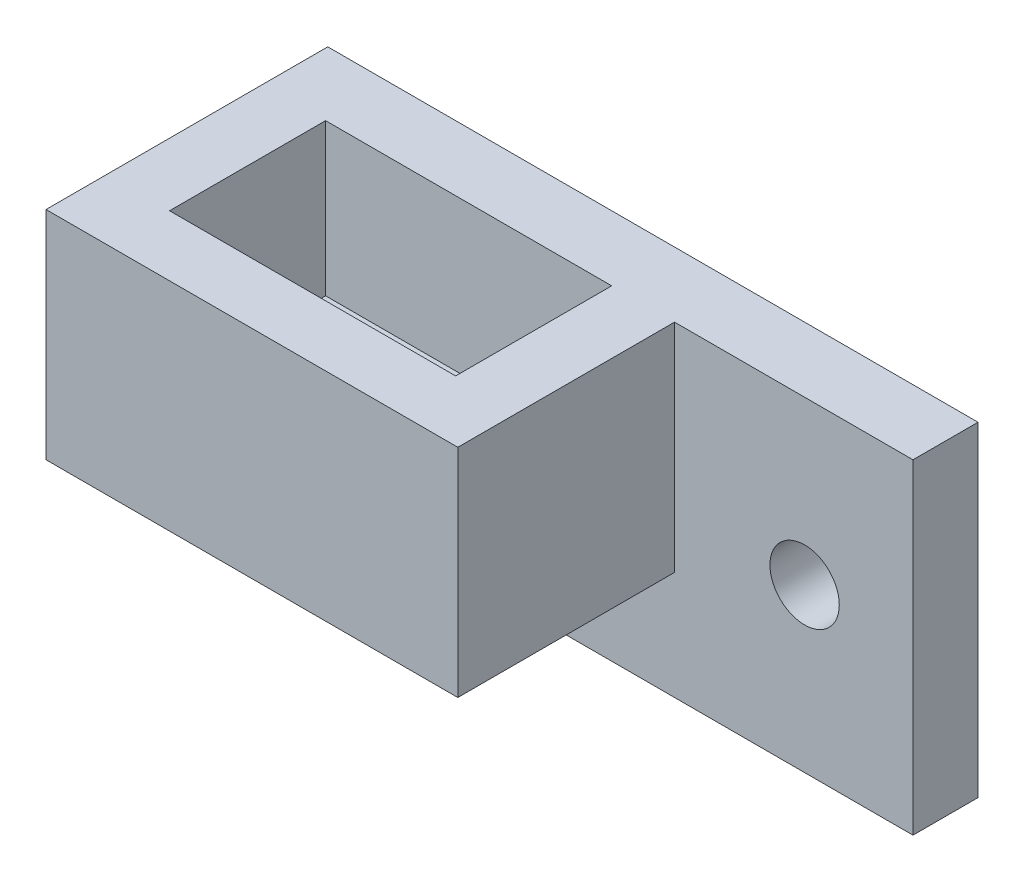
ISO-10303-21;
HEADER;
FILE_DESCRIPTION(('STEP AP214'),'2;1');
FILE_NAME('part.step','',(''),(''),'','','');
FILE_SCHEMA(('AUTOMOTIVE_DESIGN { 1 0 10303 214 1 1 1 1 }'));
ENDSEC;
DATA;
#1=APPLICATION_CONTEXT('core data for automotive mechanical design processes');
#2=APPLICATION_PROTOCOL_DEFINITION('international standard','automotive_design',2000,#1);
#3=PRODUCT_CONTEXT('',#1,'mechanical');
#4=PRODUCT('Part','Part','',(#3));
#5=PRODUCT_RELATED_PRODUCT_CATEGORY('part','',(#4));
#6=PRODUCT_DEFINITION_FORMATION('','',#4);
#7=PRODUCT_DEFINITION_CONTEXT('part definition',#1,'design');
#8=PRODUCT_DEFINITION('design','',#6,#7);
#9=PRODUCT_DEFINITION_SHAPE('','',#8);
#10=(LENGTH_UNIT() NAMED_UNIT(*) SI_UNIT(.MILLI.,.METRE.));
#11=(NAMED_UNIT(*) PLANE_ANGLE_UNIT() SI_UNIT($,.RADIAN.));
#12=(NAMED_UNIT(*) SI_UNIT($,.STERADIAN.) SOLID_ANGLE_UNIT());
#13=UNCERTAINTY_MEASURE_WITH_UNIT(LENGTH_MEASURE(1.E-05),#10,'distance_accuracy_value','');
#14=(GEOMETRIC_REPRESENTATION_CONTEXT(3) GLOBAL_UNCERTAINTY_ASSIGNED_CONTEXT((#13)) GLOBAL_UNIT_ASSIGNED_CONTEXT((#10,
#11,#12)) REPRESENTATION_CONTEXT('',''));
#15=CARTESIAN_POINT('',(0.,0.,0.));
#16=DIRECTION('',(0.,0.,1.));
#17=DIRECTION('',(1.,0.,0.));
#18=AXIS2_PLACEMENT_3D('',#15,#16,#17);
#19=CARTESIAN_POINT('',(-28.2998312846469,5.,3.));
#20=DIRECTION('',(0.,1.,0.));
#21=DIRECTION('',(-1.,0.,0.));
#22=AXIS2_PLACEMENT_3D('',#19,#20,#21);
#23=PLANE('',#22);
#24=CARTESIAN_POINT('',(-33.7998312846469,5.,6.5));
#25=DIRECTION('',(0.,1.,0.));
#26=DIRECTION('',(0.,0.,1.));
#27=AXIS2_PLACEMENT_3D('',#24,#25,#26);
#28=CIRCLE('',#27,3.2);
#29=CARTESIAN_POINT('',(-33.7998312846469,5.,9.7));
#30=VERTEX_POINT('',#29);
#31=EDGE_CURVE('E177',#30,#30,#28,.T.);
#32=ORIENTED_EDGE('',*,*,#31,.T.);
#33=EDGE_LOOP('',(#32));
#34=FACE_BOUND('',#33,.T.);
#35=DIRECTION('',(0.,0.,-1.));
#36=VECTOR('',#35,1.);
#37=CARTESIAN_POINT('',(-31.2998312846469,5.,3.));
#38=LINE('',#37,#36);
#39=CARTESIAN_POINT('',(-31.2998312846469,5.,3.));
#40=VERTEX_POINT('',#39);
#41=CARTESIAN_POINT('',(-31.2998312846469,5.,0.));
#42=VERTEX_POINT('',#41);
#43=EDGE_CURVE('E148',#40,#42,#38,.T.);
#44=ORIENTED_EDGE('',*,*,#43,.F.);
#45=DIRECTION('',(1.,0.,0.));
#46=VECTOR('',#45,1.);
#47=CARTESIAN_POINT('',(-43.2998312846469,5.,3.));
#48=LINE('',#47,#46);
#49=CARTESIAN_POINT('',(-24.2998312846469,5.,3.));
#50=VERTEX_POINT('',#49);
#51=EDGE_CURVE('E11',#40,#50,#48,.T.);
#52=ORIENTED_EDGE('',*,*,#51,.T.);
#53=DIRECTION('',(0.,0.,-1.));
#54=VECTOR('',#53,1.);
#55=CARTESIAN_POINT('',(-24.2998312846469,5.,13.));
#56=LINE('',#55,#54);
#57=CARTESIAN_POINT('',(-24.2998312846469,5.,13.));
#58=VERTEX_POINT('',#57);
#59=EDGE_CURVE('E226',#58,#50,#56,.T.);
#60=ORIENTED_EDGE('',*,*,#59,.F.);
#61=DIRECTION('',(1.,0.,0.));
#62=VECTOR('',#61,1.);
#63=CARTESIAN_POINT('',(-43.2998312846469,5.,13.));
#64=LINE('',#63,#62);
#65=CARTESIAN_POINT('',(-43.2998312846469,5.,13.));
#66=VERTEX_POINT('',#65);
#67=EDGE_CURVE('E215',#66,#58,#64,.T.);
#68=ORIENTED_EDGE('',*,*,#67,.F.);
#69=DIRECTION('',(0.,0.,-1.));
#70=VECTOR('',#69,1.);
#71=CARTESIAN_POINT('',(-43.2998312846469,5.,3.));
#72=LINE('',#71,#70);
#73=CARTESIAN_POINT('',(-43.2998312846469,5.,0.));
#74=VERTEX_POINT('',#73);
#75=EDGE_CURVE('E37',#66,#74,#72,.T.);
#76=ORIENTED_EDGE('',*,*,#75,.T.);
#77=DIRECTION('',(1.,0.,0.));
#78=VECTOR('',#77,1.);
#79=CARTESIAN_POINT('',(-28.2998312846469,5.,0.));
#80=LINE('',#79,#78);
#81=EDGE_CURVE('E157',#74,#42,#80,.T.);
#82=ORIENTED_EDGE('',*,*,#81,.T.);
#83=EDGE_LOOP('',(#44,#52,#60,#68,#76,#82));
#84=FACE_BOUND('',#83,.T.);
#85=ADVANCED_FACE('F33',(#34,#84),#23,.F.);
#86=CARTESIAN_POINT('',(0.,0.,3.));
#87=DIRECTION('',(0.,0.,-1.));
#88=DIRECTION('',(-1.,0.,0.));
#89=AXIS2_PLACEMENT_3D('',#86,#87,#88);
#90=PLANE('',#89);
#91=CARTESIAN_POINT('',(-18.2998312846469,7.5,3.));
#92=DIRECTION('',(0.,0.,1.));
#93=DIRECTION('',(1.,0.,0.));
#94=AXIS2_PLACEMENT_3D('',#91,#92,#93);
#95=CIRCLE('',#94,1.6);
#96=CARTESIAN_POINT('',(-16.6998312846469,7.5,3.));
#97=VERTEX_POINT('',#96);
#98=EDGE_CURVE('E229',#97,#97,#95,.T.);
#99=ORIENTED_EDGE('',*,*,#98,.F.);
#100=EDGE_LOOP('',(#99));
#101=FACE_BOUND('',#100,.T.);
#102=DIRECTION('',(0.,1.,0.));
#103=VECTOR('',#102,1.);
#104=CARTESIAN_POINT('',(-24.2998312846469,15.,3.));
#105=LINE('',#104,#103);
#106=CARTESIAN_POINT('',(-24.2998312846469,15.,3.));
#107=VERTEX_POINT('',#106);
#108=EDGE_CURVE('E139',#50,#107,#105,.T.);
#109=ORIENTED_EDGE('',*,*,#108,.F.);
#110=ORIENTED_EDGE('',*,*,#51,.F.);
#111=DIRECTION('',(0.,1.,0.));
#112=VECTOR('',#111,1.);
#113=CARTESIAN_POINT('',(-31.2998312846469,5.,3.));
#114=LINE('',#113,#112);
#115=CARTESIAN_POINT('',(-31.2998312846469,0.,3.));
#116=VERTEX_POINT('',#115);
#117=EDGE_CURVE('E138',#116,#40,#114,.T.);
#118=ORIENTED_EDGE('',*,*,#117,.F.);
#119=DIRECTION('',(1.,0.,0.));
#120=VECTOR('',#119,1.);
#121=CARTESIAN_POINT('',(-13.2998312846469,0.,3.));
#122=LINE('',#121,#120);
#123=CARTESIAN_POINT('',(-13.2998312846469,0.,3.));
#124=VERTEX_POINT('',#123);
#125=EDGE_CURVE('E235',#116,#124,#122,.T.);
#126=ORIENTED_EDGE('',*,*,#125,.T.);
#127=DIRECTION('',(0.,1.,0.));
#128=VECTOR('',#127,1.);
#129=CARTESIAN_POINT('',(-13.2998312846469,15.,3.));
#130=LINE('',#129,#128);
#131=CARTESIAN_POINT('',(-13.2998312846469,15.,3.));
#132=VERTEX_POINT('',#131);
#133=EDGE_CURVE('E237',#124,#132,#130,.T.);
#134=ORIENTED_EDGE('',*,*,#133,.T.);
#135=DIRECTION('',(-1.,0.,0.));
#136=VECTOR('',#135,1.);
#137=CARTESIAN_POINT('',(-43.2998312846469,15.,3.));
#138=LINE('',#137,#136);
#139=EDGE_CURVE('E57',#132,#107,#138,.T.);
#140=ORIENTED_EDGE('',*,*,#139,.T.);
#141=EDGE_LOOP('',(#109,#110,#118,#126,#134,#140));
#142=FACE_BOUND('',#141,.T.);
#143=ADVANCED_FACE('F137',(#101,#142),#90,.F.);
#144=CARTESIAN_POINT('',(0.,0.,0.));
#145=DIRECTION('',(0.,0.,-1.));
#146=DIRECTION('',(-1.,0.,0.));
#147=AXIS2_PLACEMENT_3D('',#144,#145,#146);
#148=PLANE('',#147);
#149=DIRECTION('',(0.,-1.,0.));
#150=VECTOR('',#149,1.);
#151=CARTESIAN_POINT('',(-43.2998312846469,5.,0.));
#152=LINE('',#151,#150);
#153=CARTESIAN_POINT('',(-43.2998312846469,15.,0.));
#154=VERTEX_POINT('',#153);
#155=EDGE_CURVE('E232',#154,#74,#152,.T.);
#156=ORIENTED_EDGE('',*,*,#155,.F.);
#157=DIRECTION('',(-1.,0.,0.));
#158=VECTOR('',#157,1.);
#159=CARTESIAN_POINT('',(-43.2998312846469,15.,0.));
#160=LINE('',#159,#158);
#161=CARTESIAN_POINT('',(-13.2998312846469,15.,0.));
#162=VERTEX_POINT('',#161);
#163=EDGE_CURVE('E238',#162,#154,#160,.T.);
#164=ORIENTED_EDGE('',*,*,#163,.F.);
#165=DIRECTION('',(0.,1.,0.));
#166=VECTOR('',#165,1.);
#167=CARTESIAN_POINT('',(-13.2998312846469,15.,0.));
#168=LINE('',#167,#166);
#169=CARTESIAN_POINT('',(-13.2998312846469,0.,0.));
#170=VERTEX_POINT('',#169);
#171=EDGE_CURVE('E250',#170,#162,#168,.T.);
#172=ORIENTED_EDGE('',*,*,#171,.F.);
#173=DIRECTION('',(1.,0.,0.));
#174=VECTOR('',#173,1.);
#175=CARTESIAN_POINT('',(-13.2998312846469,0.,0.));
#176=LINE('',#175,#174);
#177=CARTESIAN_POINT('',(-28.2998312846469,0.,0.));
#178=VERTEX_POINT('',#177);
#179=EDGE_CURVE('E248',#178,#170,#176,.T.);
#180=ORIENTED_EDGE('',*,*,#179,.F.);
#181=DIRECTION('',(0.,-1.,0.));
#182=VECTOR('',#181,1.);
#183=CARTESIAN_POINT('',(-28.2998312846469,0.,0.));
#184=LINE('',#183,#182);
#185=CARTESIAN_POINT('',(-28.2998312846469,5.,0.));
#186=VERTEX_POINT('',#185);
#187=EDGE_CURVE('E245',#186,#178,#184,.T.);
#188=ORIENTED_EDGE('',*,*,#187,.F.);
#189=DIRECTION('',(-1.,0.,0.));
#190=VECTOR('',#189,1.);
#191=CARTESIAN_POINT('',(0.,5.,0.));
#192=LINE('',#191,#190);
#193=EDGE_CURVE('E174',#186,#42,#192,.T.);
#194=ORIENTED_EDGE('',*,*,#193,.T.);
#195=ORIENTED_EDGE('',*,*,#81,.F.);
#196=EDGE_LOOP('',(#156,#164,#172,#180,#188,#194,#195));
#197=FACE_BOUND('',#196,.T.);
#198=CARTESIAN_POINT('',(-18.2998312846469,7.5,0.));
#199=DIRECTION('',(0.,0.,1.));
#200=DIRECTION('',(1.,0.,0.));
#201=AXIS2_PLACEMENT_3D('',#198,#199,#200);
#202=CIRCLE('',#201,1.6);
#203=CARTESIAN_POINT('',(-16.6998312846469,7.5,0.));
#204=VERTEX_POINT('',#203);
#205=EDGE_CURVE('E228',#204,#204,#202,.T.);
#206=ORIENTED_EDGE('',*,*,#205,.T.);
#207=EDGE_LOOP('',(#206));
#208=FACE_BOUND('',#207,.T.);
#209=ADVANCED_FACE('F269',(#197,#208),#148,.T.);
#210=CARTESIAN_POINT('',(-43.2998312846469,5.,3.));
#211=DIRECTION('',(1.,0.,0.));
#212=DIRECTION('',(0.,0.,-1.));
#213=AXIS2_PLACEMENT_3D('',#210,#211,#212);
#214=PLANE('',#213);
#215=ORIENTED_EDGE('',*,*,#155,.T.);
#216=ORIENTED_EDGE('',*,*,#75,.F.);
#217=DIRECTION('',(0.,-1.,0.));
#218=VECTOR('',#217,1.);
#219=CARTESIAN_POINT('',(-43.2998312846469,15.,13.));
#220=LINE('',#219,#218);
#221=CARTESIAN_POINT('',(-43.2998312846469,15.,13.));
#222=VERTEX_POINT('',#221);
#223=EDGE_CURVE('E212',#222,#66,#220,.T.);
#224=ORIENTED_EDGE('',*,*,#223,.F.);
#225=DIRECTION('',(0.,0.,-1.));
#226=VECTOR('',#225,1.);
#227=CARTESIAN_POINT('',(-43.2998312846469,15.,3.));
#228=LINE('',#227,#226);
#229=EDGE_CURVE('E241',#222,#154,#228,.T.);
#230=ORIENTED_EDGE('',*,*,#229,.T.);
#231=EDGE_LOOP('',(#215,#216,#224,#230));
#232=FACE_BOUND('',#231,.T.);
#233=ADVANCED_FACE('F35',(#232),#214,.F.);
#234=CARTESIAN_POINT('',(-13.2998312846469,0.,3.));
#235=DIRECTION('',(0.,1.,0.));
#236=DIRECTION('',(0.,0.,1.));
#237=AXIS2_PLACEMENT_3D('',#234,#235,#236);
#238=PLANE('',#237);
#239=ORIENTED_EDGE('',*,*,#179,.T.);
#240=DIRECTION('',(0.,0.,-1.));
#241=VECTOR('',#240,1.);
#242=CARTESIAN_POINT('',(-13.2998312846469,0.,3.));
#243=LINE('',#242,#241);
#244=EDGE_CURVE('E257',#124,#170,#243,.T.);
#245=ORIENTED_EDGE('',*,*,#244,.F.);
#246=ORIENTED_EDGE('',*,*,#125,.F.);
#247=DIRECTION('',(0.,0.,1.));
#248=VECTOR('',#247,1.);
#249=CARTESIAN_POINT('',(-31.2998312846469,0.,3.));
#250=LINE('',#249,#248);
#251=CARTESIAN_POINT('',(-31.2998312846469,0.,-7.));
#252=VERTEX_POINT('',#251);
#253=EDGE_CURVE('E151',#252,#116,#250,.T.);
#254=ORIENTED_EDGE('',*,*,#253,.F.);
#255=DIRECTION('',(1.,0.,0.));
#256=VECTOR('',#255,1.);
#257=CARTESIAN_POINT('',(-31.2998312846469,0.,-7.));
#258=LINE('',#257,#256);
#259=CARTESIAN_POINT('',(-28.2998312846469,0.,-7.));
#260=VERTEX_POINT('',#259);
#261=EDGE_CURVE('E163',#252,#260,#258,.T.);
#262=ORIENTED_EDGE('',*,*,#261,.T.);
#263=DIRECTION('',(0.,0.,1.));
#264=VECTOR('',#263,1.);
#265=CARTESIAN_POINT('',(-28.2998312846469,0.,3.));
#266=LINE('',#265,#264);
#267=EDGE_CURVE('E153',#260,#178,#266,.T.);
#268=ORIENTED_EDGE('',*,*,#267,.T.);
#269=EDGE_LOOP('',(#239,#245,#246,#254,#262,#268));
#270=FACE_BOUND('',#269,.T.);
#271=ADVANCED_FACE('F286',(#270),#238,.F.);
#272=CARTESIAN_POINT('',(-13.2998312846469,15.,3.));
#273=DIRECTION('',(-1.,0.,0.));
#274=DIRECTION('',(0.,0.,1.));
#275=AXIS2_PLACEMENT_3D('',#272,#273,#274);
#276=PLANE('',#275);
#277=ORIENTED_EDGE('',*,*,#171,.T.);
#278=DIRECTION('',(0.,0.,-1.));
#279=VECTOR('',#278,1.);
#280=CARTESIAN_POINT('',(-13.2998312846469,15.,3.));
#281=LINE('',#280,#279);
#282=EDGE_CURVE('E255',#132,#162,#281,.T.);
#283=ORIENTED_EDGE('',*,*,#282,.F.);
#284=ORIENTED_EDGE('',*,*,#133,.F.);
#285=ORIENTED_EDGE('',*,*,#244,.T.);
#286=EDGE_LOOP('',(#277,#283,#284,#285));
#287=FACE_BOUND('',#286,.T.);
#288=ADVANCED_FACE('F288',(#287),#276,.F.);
#289=CARTESIAN_POINT('',(-43.2998312846469,15.,3.));
#290=DIRECTION('',(0.,-1.,0.));
#291=DIRECTION('',(0.,0.,-1.));
#292=AXIS2_PLACEMENT_3D('',#289,#290,#291);
#293=PLANE('',#292);
#294=DIRECTION('',(-1.,0.,0.));
#295=VECTOR('',#294,1.);
#296=CARTESIAN_POINT('',(-27.1998312846469,15.,3.));
#297=LINE('',#296,#295);
#298=CARTESIAN_POINT('',(-27.1998312846469,15.,3.));
#299=VERTEX_POINT('',#298);
#300=CARTESIAN_POINT('',(-40.3998312846469,15.,3.));
#301=VERTEX_POINT('',#300);
#302=EDGE_CURVE('E197',#299,#301,#297,.T.);
#303=ORIENTED_EDGE('',*,*,#302,.F.);
#304=DIRECTION('',(0.,0.,-1.));
#305=VECTOR('',#304,1.);
#306=CARTESIAN_POINT('',(-27.1998312846469,15.,10.2));
#307=LINE('',#306,#305);
#308=CARTESIAN_POINT('',(-27.1998312846469,15.,10.2));
#309=VERTEX_POINT('',#308);
#310=EDGE_CURVE('E49',#309,#299,#307,.T.);
#311=ORIENTED_EDGE('',*,*,#310,.F.);
#312=DIRECTION('',(1.,0.,0.));
#313=VECTOR('',#312,1.);
#314=CARTESIAN_POINT('',(-27.1998312846469,15.,10.2));
#315=LINE('',#314,#313);
#316=CARTESIAN_POINT('',(-40.3998312846469,15.,10.2));
#317=VERTEX_POINT('',#316);
#318=EDGE_CURVE('E186',#317,#309,#315,.T.);
#319=ORIENTED_EDGE('',*,*,#318,.F.);
#320=DIRECTION('',(0.,0.,1.));
#321=VECTOR('',#320,1.);
#322=CARTESIAN_POINT('',(-40.3998312846469,15.,10.2));
#323=LINE('',#322,#321);
#324=EDGE_CURVE('E200',#301,#317,#323,.T.);
#325=ORIENTED_EDGE('',*,*,#324,.F.);
#326=EDGE_LOOP('',(#303,#311,#319,#325));
#327=FACE_BOUND('',#326,.T.);
#328=ORIENTED_EDGE('',*,*,#163,.T.);
#329=ORIENTED_EDGE('',*,*,#229,.F.);
#330=DIRECTION('',(-1.,0.,0.));
#331=VECTOR('',#330,1.);
#332=CARTESIAN_POINT('',(-43.2998312846469,15.,13.));
#333=LINE('',#332,#331);
#334=CARTESIAN_POINT('',(-24.2998312846469,15.,13.));
#335=VERTEX_POINT('',#334);
#336=EDGE_CURVE('E219',#335,#222,#333,.T.);
#337=ORIENTED_EDGE('',*,*,#336,.F.);
#338=DIRECTION('',(0.,0.,-1.));
#339=VECTOR('',#338,1.);
#340=CARTESIAN_POINT('',(-24.2998312846469,15.,13.));
#341=LINE('',#340,#339);
#342=EDGE_CURVE('E221',#335,#107,#341,.T.);
#343=ORIENTED_EDGE('',*,*,#342,.T.);
#344=ORIENTED_EDGE('',*,*,#139,.F.);
#345=ORIENTED_EDGE('',*,*,#282,.T.);
#346=EDGE_LOOP('',(#328,#329,#337,#343,#344,#345));
#347=FACE_BOUND('',#346,.T.);
#348=ADVANCED_FACE('F290',(#327,#347),#293,.F.);
#349=CARTESIAN_POINT('',(-18.2998312846469,7.5,3.));
#350=DIRECTION('',(0.,0.,-1.));
#351=DIRECTION('',(-1.,0.,0.));
#352=AXIS2_PLACEMENT_3D('',#349,#350,#351);
#353=CYLINDRICAL_SURFACE('',#352,1.6);
#354=ORIENTED_EDGE('',*,*,#98,.T.);
#355=EDGE_LOOP('',(#354));
#356=FACE_BOUND('',#355,.T.);
#357=ORIENTED_EDGE('',*,*,#205,.F.);
#358=EDGE_LOOP('',(#357));
#359=FACE_BOUND('',#358,.T.);
#360=ADVANCED_FACE('F307',(#356,#359),#353,.F.);
#361=CARTESIAN_POINT('',(-24.2998312846469,15.,13.));
#362=DIRECTION('',(-1.,0.,0.));
#363=DIRECTION('',(0.,0.,1.));
#364=AXIS2_PLACEMENT_3D('',#361,#362,#363);
#365=PLANE('',#364);
#366=ORIENTED_EDGE('',*,*,#108,.T.);
#367=ORIENTED_EDGE('',*,*,#342,.F.);
#368=DIRECTION('',(0.,1.,0.));
#369=VECTOR('',#368,1.);
#370=CARTESIAN_POINT('',(-24.2998312846469,15.,13.));
#371=LINE('',#370,#369);
#372=EDGE_CURVE('E217',#58,#335,#371,.T.);
#373=ORIENTED_EDGE('',*,*,#372,.F.);
#374=ORIENTED_EDGE('',*,*,#59,.T.);
#375=EDGE_LOOP('',(#366,#367,#373,#374));
#376=FACE_BOUND('',#375,.T.);
#377=ADVANCED_FACE('F295',(#376),#365,.F.);
#378=CARTESIAN_POINT('',(0.,0.,13.));
#379=DIRECTION('',(0.,0.,1.));
#380=DIRECTION('',(1.,0.,0.));
#381=AXIS2_PLACEMENT_3D('',#378,#379,#380);
#382=PLANE('',#381);
#383=ORIENTED_EDGE('',*,*,#223,.T.);
#384=ORIENTED_EDGE('',*,*,#67,.T.);
#385=ORIENTED_EDGE('',*,*,#372,.T.);
#386=ORIENTED_EDGE('',*,*,#336,.T.);
#387=EDGE_LOOP('',(#383,#384,#385,#386));
#388=FACE_BOUND('',#387,.T.);
#389=ADVANCED_FACE('F297',(#388),#382,.T.);
#390=CARTESIAN_POINT('',(-27.1998312846469,8.,10.2));
#391=DIRECTION('',(1.,0.,0.));
#392=DIRECTION('',(0.,0.,-1.));
#393=AXIS2_PLACEMENT_3D('',#390,#391,#392);
#394=PLANE('',#393);
#395=ORIENTED_EDGE('',*,*,#310,.T.);
#396=DIRECTION('',(0.,1.,0.));
#397=VECTOR('',#396,1.);
#398=CARTESIAN_POINT('',(-27.1998312846469,8.,3.));
#399=LINE('',#398,#397);
#400=CARTESIAN_POINT('',(-27.1998312846469,8.,3.));
#401=VERTEX_POINT('',#400);
#402=EDGE_CURVE('E195',#401,#299,#399,.T.);
#403=ORIENTED_EDGE('',*,*,#402,.F.);
#404=DIRECTION('',(0.,0.,-1.));
#405=VECTOR('',#404,1.);
#406=CARTESIAN_POINT('',(-27.1998312846469,8.,10.2));
#407=LINE('',#406,#405);
#408=CARTESIAN_POINT('',(-27.1998312846469,8.,10.2));
#409=VERTEX_POINT('',#408);
#410=EDGE_CURVE('E182',#409,#401,#407,.T.);
#411=ORIENTED_EDGE('',*,*,#410,.F.);
#412=DIRECTION('',(0.,1.,0.));
#413=VECTOR('',#412,1.);
#414=CARTESIAN_POINT('',(-27.1998312846469,8.,10.2));
#415=LINE('',#414,#413);
#416=EDGE_CURVE('E205',#409,#309,#415,.T.);
#417=ORIENTED_EDGE('',*,*,#416,.T.);
#418=EDGE_LOOP('',(#395,#403,#411,#417));
#419=FACE_BOUND('',#418,.T.);
#420=ADVANCED_FACE('F299',(#419),#394,.F.);
#421=CARTESIAN_POINT('',(-27.1998312846469,8.,10.2));
#422=DIRECTION('',(0.,0.,1.));
#423=DIRECTION('',(1.,0.,0.));
#424=AXIS2_PLACEMENT_3D('',#421,#422,#423);
#425=PLANE('',#424);
#426=ORIENTED_EDGE('',*,*,#318,.T.);
#427=ORIENTED_EDGE('',*,*,#416,.F.);
#428=DIRECTION('',(1.,0.,0.));
#429=VECTOR('',#428,1.);
#430=CARTESIAN_POINT('',(-27.1998312846469,8.,10.2));
#431=LINE('',#430,#429);
#432=CARTESIAN_POINT('',(-40.3998312846469,8.,10.2));
#433=VERTEX_POINT('',#432);
#434=EDGE_CURVE('E192',#433,#409,#431,.T.);
#435=ORIENTED_EDGE('',*,*,#434,.F.);
#436=DIRECTION('',(0.,1.,0.));
#437=VECTOR('',#436,1.);
#438=CARTESIAN_POINT('',(-40.3998312846469,8.,10.2));
#439=LINE('',#438,#437);
#440=EDGE_CURVE('E207',#433,#317,#439,.T.);
#441=ORIENTED_EDGE('',*,*,#440,.T.);
#442=EDGE_LOOP('',(#426,#427,#435,#441));
#443=FACE_BOUND('',#442,.T.);
#444=ADVANCED_FACE('F305',(#443),#425,.F.);
#445=CARTESIAN_POINT('',(-40.3998312846469,8.,10.2));
#446=DIRECTION('',(-1.,0.,0.));
#447=DIRECTION('',(0.,0.,1.));
#448=AXIS2_PLACEMENT_3D('',#445,#446,#447);
#449=PLANE('',#448);
#450=ORIENTED_EDGE('',*,*,#324,.T.);
#451=ORIENTED_EDGE('',*,*,#440,.F.);
#452=DIRECTION('',(0.,0.,1.));
#453=VECTOR('',#452,1.);
#454=CARTESIAN_POINT('',(-40.3998312846469,8.,10.2));
#455=LINE('',#454,#453);
#456=CARTESIAN_POINT('',(-40.3998312846469,8.,3.));
#457=VERTEX_POINT('',#456);
#458=EDGE_CURVE('E189',#457,#433,#455,.T.);
#459=ORIENTED_EDGE('',*,*,#458,.F.);
#460=DIRECTION('',(0.,1.,0.));
#461=VECTOR('',#460,1.);
#462=CARTESIAN_POINT('',(-40.3998312846469,8.,3.));
#463=LINE('',#462,#461);
#464=EDGE_CURVE('E209',#457,#301,#463,.T.);
#465=ORIENTED_EDGE('',*,*,#464,.T.);
#466=EDGE_LOOP('',(#450,#451,#459,#465));
#467=FACE_BOUND('',#466,.T.);
#468=ADVANCED_FACE('F370',(#467),#449,.F.);
#469=CARTESIAN_POINT('',(-27.1998312846469,8.,3.));
#470=DIRECTION('',(0.,0.,-1.));
#471=DIRECTION('',(-1.,0.,0.));
#472=AXIS2_PLACEMENT_3D('',#469,#470,#471);
#473=PLANE('',#472);
#474=ORIENTED_EDGE('',*,*,#302,.T.);
#475=ORIENTED_EDGE('',*,*,#464,.F.);
#476=DIRECTION('',(-1.,0.,0.));
#477=VECTOR('',#476,1.);
#478=CARTESIAN_POINT('',(-27.1998312846469,8.,3.));
#479=LINE('',#478,#477);
#480=EDGE_CURVE('E185',#401,#457,#479,.T.);
#481=ORIENTED_EDGE('',*,*,#480,.F.);
#482=ORIENTED_EDGE('',*,*,#402,.T.);
#483=EDGE_LOOP('',(#474,#475,#481,#482));
#484=FACE_BOUND('',#483,.T.);
#485=ADVANCED_FACE('F380',(#484),#473,.F.);
#486=CARTESIAN_POINT('',(0.,8.,0.));
#487=DIRECTION('',(0.,1.,0.));
#488=DIRECTION('',(0.,0.,1.));
#489=AXIS2_PLACEMENT_3D('',#486,#487,#488);
#490=PLANE('',#489);
#491=CARTESIAN_POINT('',(-33.7998312846469,8.,6.5));
#492=DIRECTION('',(0.,1.,0.));
#493=DIRECTION('',(0.,0.,1.));
#494=AXIS2_PLACEMENT_3D('',#491,#492,#493);
#495=CIRCLE('',#494,3.2);
#496=CARTESIAN_POINT('',(-33.7998312846469,8.,9.7));
#497=VERTEX_POINT('',#496);
#498=EDGE_CURVE('E176',#497,#497,#495,.T.);
#499=ORIENTED_EDGE('',*,*,#498,.F.);
#500=EDGE_LOOP('',(#499));
#501=FACE_BOUND('',#500,.T.);
#502=ORIENTED_EDGE('',*,*,#410,.T.);
#503=ORIENTED_EDGE('',*,*,#480,.T.);
#504=ORIENTED_EDGE('',*,*,#458,.T.);
#505=ORIENTED_EDGE('',*,*,#434,.T.);
#506=EDGE_LOOP('',(#502,#503,#504,#505));
#507=FACE_BOUND('',#506,.T.);
#508=ADVANCED_FACE('F390',(#501,#507),#490,.T.);
#509=CARTESIAN_POINT('',(-33.7998312846469,5.,6.5));
#510=DIRECTION('',(0.,1.,0.));
#511=DIRECTION('',(0.,0.,1.));
#512=AXIS2_PLACEMENT_3D('',#509,#510,#511);
#513=CYLINDRICAL_SURFACE('',#512,3.2);
#514=ORIENTED_EDGE('',*,*,#31,.F.);
#515=EDGE_LOOP('',(#514));
#516=FACE_BOUND('',#515,.T.);
#517=ORIENTED_EDGE('',*,*,#498,.T.);
#518=EDGE_LOOP('',(#517));
#519=FACE_BOUND('',#518,.T.);
#520=ADVANCED_FACE('F399',(#516,#519),#513,.F.);
#521=CARTESIAN_POINT('',(-31.2998312846469,5.,3.));
#522=DIRECTION('',(0.,-1.,0.));
#523=DIRECTION('',(0.,0.,-1.));
#524=AXIS2_PLACEMENT_3D('',#521,#522,#523);
#525=PLANE('',#524);
#526=ORIENTED_EDGE('',*,*,#193,.F.);
#527=DIRECTION('',(0.,0.,-1.));
#528=VECTOR('',#527,1.);
#529=CARTESIAN_POINT('',(-28.2998312846469,5.,3.));
#530=LINE('',#529,#528);
#531=CARTESIAN_POINT('',(-28.2998312846469,5.,-7.));
#532=VERTEX_POINT('',#531);
#533=EDGE_CURVE('E164',#186,#532,#530,.T.);
#534=ORIENTED_EDGE('',*,*,#533,.T.);
#535=DIRECTION('',(1.,0.,0.));
#536=VECTOR('',#535,1.);
#537=CARTESIAN_POINT('',(-31.2998312846469,5.,-7.));
#538=LINE('',#537,#536);
#539=CARTESIAN_POINT('',(-31.2998312846469,5.,-7.));
#540=VERTEX_POINT('',#539);
#541=EDGE_CURVE('E171',#540,#532,#538,.T.);
#542=ORIENTED_EDGE('',*,*,#541,.F.);
#543=EDGE_CURVE('E152',#42,#540,#38,.T.);
#544=ORIENTED_EDGE('',*,*,#543,.F.);
#545=EDGE_LOOP('',(#526,#534,#542,#544));
#546=FACE_BOUND('',#545,.T.);
#547=ADVANCED_FACE('F275',(#546),#525,.F.);
#548=CARTESIAN_POINT('',(-31.2998312846469,5.,-7.));
#549=DIRECTION('',(0.,0.,1.));
#550=DIRECTION('',(0.,-1.,0.));
#551=AXIS2_PLACEMENT_3D('',#548,#549,#550);
#552=PLANE('',#551);
#553=DIRECTION('',(0.,-1.,0.));
#554=VECTOR('',#553,1.);
#555=CARTESIAN_POINT('',(-28.2998312846469,5.,-7.));
#556=LINE('',#555,#554);
#557=EDGE_CURVE('E166',#532,#260,#556,.T.);
#558=ORIENTED_EDGE('',*,*,#557,.T.);
#559=ORIENTED_EDGE('',*,*,#261,.F.);
#560=DIRECTION('',(0.,-1.,0.));
#561=VECTOR('',#560,1.);
#562=CARTESIAN_POINT('',(-31.2998312846469,5.,-7.));
#563=LINE('',#562,#561);
#564=EDGE_CURVE('E158',#540,#252,#563,.T.);
#565=ORIENTED_EDGE('',*,*,#564,.F.);
#566=ORIENTED_EDGE('',*,*,#541,.T.);
#567=EDGE_LOOP('',(#558,#559,#565,#566));
#568=FACE_BOUND('',#567,.T.);
#569=ADVANCED_FACE('F283',(#568),#552,.F.);
#570=CARTESIAN_POINT('',(-31.2998312846469,0.,0.));
#571=DIRECTION('',(1.,0.,0.));
#572=DIRECTION('',(0.,0.,-1.));
#573=AXIS2_PLACEMENT_3D('',#570,#571,#572);
#574=PLANE('',#573);
#575=ORIENTED_EDGE('',*,*,#117,.T.);
#576=ORIENTED_EDGE('',*,*,#43,.T.);
#577=ORIENTED_EDGE('',*,*,#543,.T.);
#578=ORIENTED_EDGE('',*,*,#564,.T.);
#579=ORIENTED_EDGE('',*,*,#253,.T.);
#580=EDGE_LOOP('',(#575,#576,#577,#578,#579));
#581=FACE_BOUND('',#580,.T.);
#582=ADVANCED_FACE('F147',(#581),#574,.F.);
#583=CARTESIAN_POINT('',(-28.2998312846469,0.,0.));
#584=DIRECTION('',(1.,0.,0.));
#585=DIRECTION('',(0.,0.,-1.));
#586=AXIS2_PLACEMENT_3D('',#583,#584,#585);
#587=PLANE('',#586);
#588=ORIENTED_EDGE('',*,*,#533,.F.);
#589=ORIENTED_EDGE('',*,*,#187,.T.);
#590=ORIENTED_EDGE('',*,*,#267,.F.);
#591=ORIENTED_EDGE('',*,*,#557,.F.);
#592=EDGE_LOOP('',(#588,#589,#590,#591));
#593=FACE_BOUND('',#592,.T.);
#594=ADVANCED_FACE('F279',(#593),#587,.T.);
#595=CLOSED_SHELL('',(#85,#143,#209,#233,#271,#288,#348,#360,#377,#389,#420,#444,#468,#485,#508,
#520,#547,#569,#582,#594));
#596=MANIFOLD_SOLID_BREP('B2',#595);
#597=ADVANCED_BREP_SHAPE_REPRESENTATION('',(#18,#596),#14);
#598=SHAPE_DEFINITION_REPRESENTATION(#9,#597);
ENDSEC;
END-ISO-10303-21;
